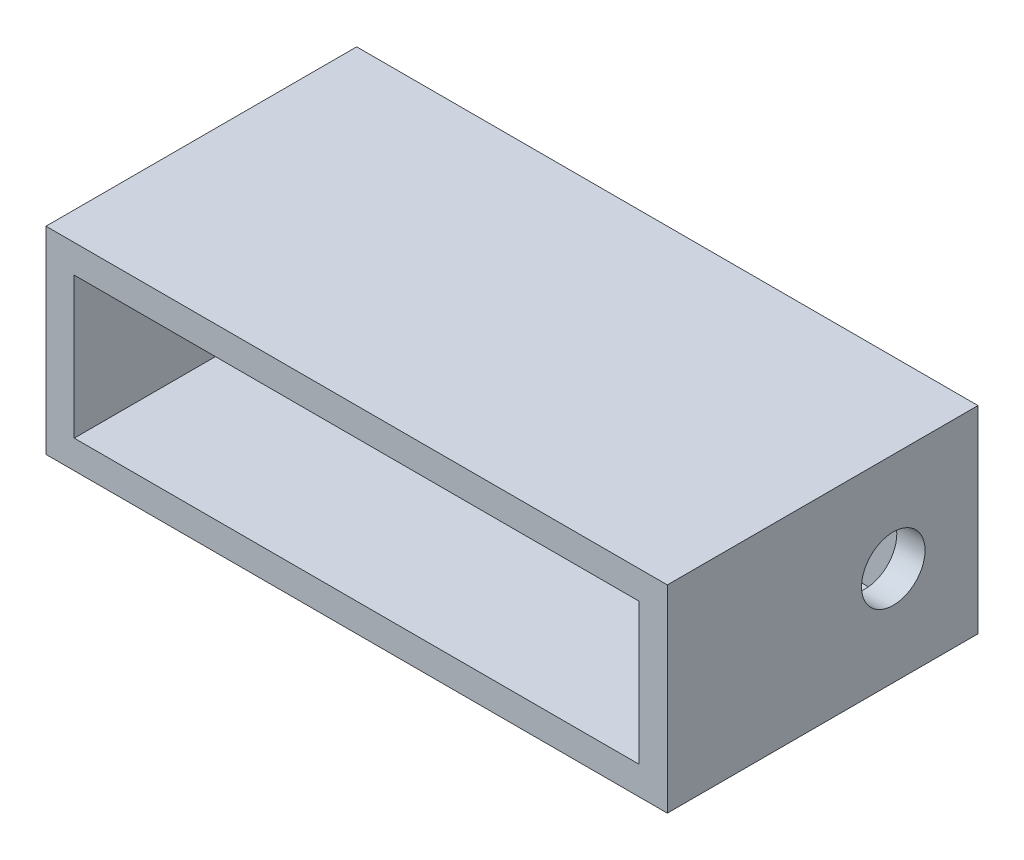
ISO-10303-21;
HEADER;
FILE_DESCRIPTION(('STEP AP214'),'2;1');
FILE_NAME('part.step','',(''),(''),'','','');
FILE_SCHEMA(('AUTOMOTIVE_DESIGN { 1 0 10303 214 1 1 1 1 }'));
ENDSEC;
DATA;
#1=APPLICATION_CONTEXT('core data for automotive mechanical design processes');
#2=APPLICATION_PROTOCOL_DEFINITION('international standard','automotive_design',2000,#1);
#3=PRODUCT_CONTEXT('',#1,'mechanical');
#4=PRODUCT('Part','Part','',(#3));
#5=PRODUCT_RELATED_PRODUCT_CATEGORY('part','',(#4));
#6=PRODUCT_DEFINITION_FORMATION('','',#4);
#7=PRODUCT_DEFINITION_CONTEXT('part definition',#1,'design');
#8=PRODUCT_DEFINITION('design','',#6,#7);
#9=PRODUCT_DEFINITION_SHAPE('','',#8);
#10=(LENGTH_UNIT() NAMED_UNIT(*) SI_UNIT(.MILLI.,.METRE.));
#11=(NAMED_UNIT(*) PLANE_ANGLE_UNIT() SI_UNIT($,.RADIAN.));
#12=(NAMED_UNIT(*) SI_UNIT($,.STERADIAN.) SOLID_ANGLE_UNIT());
#13=UNCERTAINTY_MEASURE_WITH_UNIT(LENGTH_MEASURE(1.E-05),#10,'distance_accuracy_value','');
#14=(GEOMETRIC_REPRESENTATION_CONTEXT(3) GLOBAL_UNCERTAINTY_ASSIGNED_CONTEXT((#13)) GLOBAL_UNIT_ASSIGNED_CONTEXT((#10,
#11,#12)) REPRESENTATION_CONTEXT('',''));
#15=CARTESIAN_POINT('',(0.,0.,0.));
#16=DIRECTION('',(0.,0.,1.));
#17=DIRECTION('',(1.,0.,0.));
#18=AXIS2_PLACEMENT_3D('',#15,#16,#17);
#19=CARTESIAN_POINT('',(-22.,-7.,22.));
#20=DIRECTION('',(1.,0.,0.));
#21=DIRECTION('',(0.,0.,-1.));
#22=AXIS2_PLACEMENT_3D('',#19,#20,#21);
#23=PLANE('',#22);
#24=DIRECTION('',(0.,-1.,0.));
#25=VECTOR('',#24,1.);
#26=CARTESIAN_POINT('',(-22.,-7.,0.));
#27=LINE('',#26,#25);
#28=CARTESIAN_POINT('',(-22.,7.,0.));
#29=VERTEX_POINT('',#28);
#30=CARTESIAN_POINT('',(-22.,-7.,0.));
#31=VERTEX_POINT('',#30);
#32=EDGE_CURVE('E144',#29,#31,#27,.T.);
#33=ORIENTED_EDGE('',*,*,#32,.T.);
#34=DIRECTION('',(0.,0.,-1.));
#35=VECTOR('',#34,1.);
#36=CARTESIAN_POINT('',(-22.,-7.,22.));
#37=LINE('',#36,#35);
#38=CARTESIAN_POINT('',(-22.,-7.,22.));
#39=VERTEX_POINT('',#38);
#40=EDGE_CURVE('E11',#39,#31,#37,.T.);
#41=ORIENTED_EDGE('',*,*,#40,.F.);
#42=DIRECTION('',(0.,-1.,0.));
#43=VECTOR('',#42,1.);
#44=CARTESIAN_POINT('',(-22.,-7.,22.));
#45=LINE('',#44,#43);
#46=CARTESIAN_POINT('',(-22.,7.,22.));
#47=VERTEX_POINT('',#46);
#48=EDGE_CURVE('E148',#47,#39,#45,.T.);
#49=ORIENTED_EDGE('',*,*,#48,.F.);
#50=DIRECTION('',(0.,0.,-1.));
#51=VECTOR('',#50,1.);
#52=CARTESIAN_POINT('',(-22.,7.,22.));
#53=LINE('',#52,#51);
#54=EDGE_CURVE('E154',#47,#29,#53,.T.);
#55=ORIENTED_EDGE('',*,*,#54,.T.);
#56=EDGE_LOOP('',(#33,#41,#49,#55));
#57=FACE_BOUND('',#56,.T.);
#58=ADVANCED_FACE('F33',(#57),#23,.F.);
#59=CARTESIAN_POINT('',(22.,-7.,22.));
#60=DIRECTION('',(0.,1.,0.));
#61=DIRECTION('',(-1.,0.,0.));
#62=AXIS2_PLACEMENT_3D('',#59,#60,#61);
#63=PLANE('',#62);
#64=DIRECTION('',(1.,0.,0.));
#65=VECTOR('',#64,1.);
#66=CARTESIAN_POINT('',(22.,-7.,0.));
#67=LINE('',#66,#65);
#68=CARTESIAN_POINT('',(22.,-7.,0.));
#69=VERTEX_POINT('',#68);
#70=EDGE_CURVE('E157',#31,#69,#67,.T.);
#71=ORIENTED_EDGE('',*,*,#70,.T.);
#72=DIRECTION('',(0.,0.,-1.));
#73=VECTOR('',#72,1.);
#74=CARTESIAN_POINT('',(22.,-7.,22.));
#75=LINE('',#74,#73);
#76=CARTESIAN_POINT('',(22.,-7.,22.));
#77=VERTEX_POINT('',#76);
#78=EDGE_CURVE('E41',#77,#69,#75,.T.);
#79=ORIENTED_EDGE('',*,*,#78,.F.);
#80=DIRECTION('',(1.,0.,0.));
#81=VECTOR('',#80,1.);
#82=CARTESIAN_POINT('',(22.,-7.,22.));
#83=LINE('',#82,#81);
#84=EDGE_CURVE('E85',#39,#77,#83,.T.);
#85=ORIENTED_EDGE('',*,*,#84,.F.);
#86=ORIENTED_EDGE('',*,*,#40,.T.);
#87=EDGE_LOOP('',(#71,#79,#85,#86));
#88=FACE_BOUND('',#87,.T.);
#89=ADVANCED_FACE('F187',(#88),#63,.F.);
#90=CARTESIAN_POINT('',(22.,-7.,22.));
#91=DIRECTION('',(-1.,0.,0.));
#92=DIRECTION('',(0.,0.,1.));
#93=AXIS2_PLACEMENT_3D('',#90,#91,#92);
#94=PLANE('',#93);
#95=CARTESIAN_POINT('',(22.,0.,6.));
#96=DIRECTION('',(1.,0.,0.));
#97=DIRECTION('',(0.,0.,-1.));
#98=AXIS2_PLACEMENT_3D('',#95,#96,#97);
#99=CIRCLE('',#98,2.25);
#100=CARTESIAN_POINT('',(22.,0.,3.75));
#101=VERTEX_POINT('',#100);
#102=EDGE_CURVE('E133',#101,#101,#99,.T.);
#103=ORIENTED_EDGE('',*,*,#102,.F.);
#104=EDGE_LOOP('',(#103));
#105=FACE_BOUND('',#104,.T.);
#106=DIRECTION('',(0.,1.,0.));
#107=VECTOR('',#106,1.);
#108=CARTESIAN_POINT('',(22.,-7.,0.));
#109=LINE('',#108,#107);
#110=CARTESIAN_POINT('',(22.,7.,0.));
#111=VERTEX_POINT('',#110);
#112=EDGE_CURVE('E159',#69,#111,#109,.T.);
#113=ORIENTED_EDGE('',*,*,#112,.T.);
#114=DIRECTION('',(0.,0.,-1.));
#115=VECTOR('',#114,1.);
#116=CARTESIAN_POINT('',(22.,7.,22.));
#117=LINE('',#116,#115);
#118=CARTESIAN_POINT('',(22.,7.,22.));
#119=VERTEX_POINT('',#118);
#120=EDGE_CURVE('E163',#119,#111,#117,.T.);
#121=ORIENTED_EDGE('',*,*,#120,.F.);
#122=DIRECTION('',(0.,1.,0.));
#123=VECTOR('',#122,1.);
#124=CARTESIAN_POINT('',(22.,-7.,22.));
#125=LINE('',#124,#123);
#126=EDGE_CURVE('E151',#77,#119,#125,.T.);
#127=ORIENTED_EDGE('',*,*,#126,.F.);
#128=ORIENTED_EDGE('',*,*,#78,.T.);
#129=EDGE_LOOP('',(#113,#121,#127,#128));
#130=FACE_BOUND('',#129,.T.);
#131=ADVANCED_FACE('F169',(#105,#130),#94,.F.);
#132=CARTESIAN_POINT('',(22.,7.,22.));
#133=DIRECTION('',(0.,-1.,0.));
#134=DIRECTION('',(1.,0.,0.));
#135=AXIS2_PLACEMENT_3D('',#132,#133,#134);
#136=PLANE('',#135);
#137=DIRECTION('',(-1.,0.,0.));
#138=VECTOR('',#137,1.);
#139=CARTESIAN_POINT('',(22.,7.,0.));
#140=LINE('',#139,#138);
#141=EDGE_CURVE('E78',#111,#29,#140,.T.);
#142=ORIENTED_EDGE('',*,*,#141,.T.);
#143=ORIENTED_EDGE('',*,*,#54,.F.);
#144=DIRECTION('',(-1.,0.,0.));
#145=VECTOR('',#144,1.);
#146=CARTESIAN_POINT('',(22.,7.,22.));
#147=LINE('',#146,#145);
#148=EDGE_CURVE('E57',#119,#47,#147,.T.);
#149=ORIENTED_EDGE('',*,*,#148,.F.);
#150=ORIENTED_EDGE('',*,*,#120,.T.);
#151=EDGE_LOOP('',(#142,#143,#149,#150));
#152=FACE_BOUND('',#151,.T.);
#153=ADVANCED_FACE('F177',(#152),#136,.F.);
#154=CARTESIAN_POINT('',(0.,0.,22.));
#155=DIRECTION('',(0.,0.,1.));
#156=DIRECTION('',(1.,0.,0.));
#157=AXIS2_PLACEMENT_3D('',#154,#155,#156);
#158=PLANE('',#157);
#159=DIRECTION('',(0.,-1.,0.));
#160=VECTOR('',#159,1.);
#161=CARTESIAN_POINT('',(-20.,-5.,22.));
#162=LINE('',#161,#160);
#163=CARTESIAN_POINT('',(-20.,5.,22.));
#164=VERTEX_POINT('',#163);
#165=CARTESIAN_POINT('',(-20.,-5.,22.));
#166=VERTEX_POINT('',#165);
#167=EDGE_CURVE('E48',#164,#166,#162,.T.);
#168=ORIENTED_EDGE('',*,*,#167,.F.);
#169=DIRECTION('',(-1.,0.,0.));
#170=VECTOR('',#169,1.);
#171=CARTESIAN_POINT('',(20.,5.,22.));
#172=LINE('',#171,#170);
#173=CARTESIAN_POINT('',(20.,5.,22.));
#174=VERTEX_POINT('',#173);
#175=EDGE_CURVE('E127',#174,#164,#172,.T.);
#176=ORIENTED_EDGE('',*,*,#175,.F.);
#177=DIRECTION('',(0.,1.,0.));
#178=VECTOR('',#177,1.);
#179=CARTESIAN_POINT('',(20.,-5.,22.));
#180=LINE('',#179,#178);
#181=CARTESIAN_POINT('',(20.,-5.,22.));
#182=VERTEX_POINT('',#181);
#183=EDGE_CURVE('E130',#182,#174,#180,.T.);
#184=ORIENTED_EDGE('',*,*,#183,.F.);
#185=DIRECTION('',(1.,0.,0.));
#186=VECTOR('',#185,1.);
#187=CARTESIAN_POINT('',(20.,-5.,22.));
#188=LINE('',#187,#186);
#189=EDGE_CURVE('E138',#166,#182,#188,.T.);
#190=ORIENTED_EDGE('',*,*,#189,.F.);
#191=EDGE_LOOP('',(#168,#176,#184,#190));
#192=FACE_BOUND('',#191,.T.);
#193=ORIENTED_EDGE('',*,*,#48,.T.);
#194=ORIENTED_EDGE('',*,*,#84,.T.);
#195=ORIENTED_EDGE('',*,*,#126,.T.);
#196=ORIENTED_EDGE('',*,*,#148,.T.);
#197=EDGE_LOOP('',(#193,#194,#195,#196));
#198=FACE_BOUND('',#197,.T.);
#199=ADVANCED_FACE('F179',(#192,#198),#158,.T.);
#200=CARTESIAN_POINT('',(0.,0.,0.));
#201=DIRECTION('',(0.,0.,1.));
#202=DIRECTION('',(1.,0.,0.));
#203=AXIS2_PLACEMENT_3D('',#200,#201,#202);
#204=PLANE('',#203);
#205=ORIENTED_EDGE('',*,*,#32,.F.);
#206=ORIENTED_EDGE('',*,*,#141,.F.);
#207=ORIENTED_EDGE('',*,*,#112,.F.);
#208=ORIENTED_EDGE('',*,*,#70,.F.);
#209=EDGE_LOOP('',(#205,#206,#207,#208));
#210=FACE_BOUND('',#209,.T.);
#211=ADVANCED_FACE('F173',(#210),#204,.F.);
#212=CARTESIAN_POINT('',(-20.,-5.,3.));
#213=DIRECTION('',(-1.,0.,0.));
#214=DIRECTION('',(0.,0.,1.));
#215=AXIS2_PLACEMENT_3D('',#212,#213,#214);
#216=PLANE('',#215);
#217=ORIENTED_EDGE('',*,*,#167,.T.);
#218=DIRECTION('',(0.,0.,1.));
#219=VECTOR('',#218,1.);
#220=CARTESIAN_POINT('',(-20.,-5.,3.));
#221=LINE('',#220,#219);
#222=CARTESIAN_POINT('',(-20.,-5.,3.));
#223=VERTEX_POINT('',#222);
#224=EDGE_CURVE('E105',#223,#166,#221,.T.);
#225=ORIENTED_EDGE('',*,*,#224,.F.);
#226=DIRECTION('',(0.,-1.,0.));
#227=VECTOR('',#226,1.);
#228=CARTESIAN_POINT('',(-20.,-5.,3.));
#229=LINE('',#228,#227);
#230=CARTESIAN_POINT('',(-20.,5.,3.));
#231=VERTEX_POINT('',#230);
#232=EDGE_CURVE('E109',#231,#223,#229,.T.);
#233=ORIENTED_EDGE('',*,*,#232,.F.);
#234=DIRECTION('',(0.,0.,1.));
#235=VECTOR('',#234,1.);
#236=CARTESIAN_POINT('',(-20.,5.,3.));
#237=LINE('',#236,#235);
#238=EDGE_CURVE('E142',#231,#164,#237,.T.);
#239=ORIENTED_EDGE('',*,*,#238,.T.);
#240=EDGE_LOOP('',(#217,#225,#233,#239));
#241=FACE_BOUND('',#240,.T.);
#242=ADVANCED_FACE('F107',(#241),#216,.F.);
#243=CARTESIAN_POINT('',(20.,5.,3.));
#244=DIRECTION('',(0.,1.,0.));
#245=DIRECTION('',(-1.,0.,0.));
#246=AXIS2_PLACEMENT_3D('',#243,#244,#245);
#247=PLANE('',#246);
#248=ORIENTED_EDGE('',*,*,#175,.T.);
#249=ORIENTED_EDGE('',*,*,#238,.F.);
#250=DIRECTION('',(-1.,0.,0.));
#251=VECTOR('',#250,1.);
#252=CARTESIAN_POINT('',(20.,5.,3.));
#253=LINE('',#252,#251);
#254=CARTESIAN_POINT('',(20.,5.,3.));
#255=VERTEX_POINT('',#254);
#256=EDGE_CURVE('E115',#255,#231,#253,.T.);
#257=ORIENTED_EDGE('',*,*,#256,.F.);
#258=DIRECTION('',(0.,0.,1.));
#259=VECTOR('',#258,1.);
#260=CARTESIAN_POINT('',(20.,5.,3.));
#261=LINE('',#260,#259);
#262=EDGE_CURVE('E145',#255,#174,#261,.T.);
#263=ORIENTED_EDGE('',*,*,#262,.T.);
#264=EDGE_LOOP('',(#248,#249,#257,#263));
#265=FACE_BOUND('',#264,.T.);
#266=ADVANCED_FACE('F217',(#265),#247,.F.);
#267=CARTESIAN_POINT('',(20.,-5.,3.));
#268=DIRECTION('',(1.,0.,0.));
#269=DIRECTION('',(0.,0.,-1.));
#270=AXIS2_PLACEMENT_3D('',#267,#268,#269);
#271=PLANE('',#270);
#272=CARTESIAN_POINT('',(20.,0.,6.));
#273=DIRECTION('',(1.,0.,0.));
#274=DIRECTION('',(0.,0.,-1.));
#275=AXIS2_PLACEMENT_3D('',#272,#273,#274);
#276=CIRCLE('',#275,2.25);
#277=CARTESIAN_POINT('',(20.,0.,3.75));
#278=VERTEX_POINT('',#277);
#279=EDGE_CURVE('E36',#278,#278,#276,.T.);
#280=ORIENTED_EDGE('',*,*,#279,.T.);
#281=EDGE_LOOP('',(#280));
#282=FACE_BOUND('',#281,.T.);
#283=ORIENTED_EDGE('',*,*,#183,.T.);
#284=ORIENTED_EDGE('',*,*,#262,.F.);
#285=DIRECTION('',(0.,1.,0.));
#286=VECTOR('',#285,1.);
#287=CARTESIAN_POINT('',(20.,-5.,3.));
#288=LINE('',#287,#286);
#289=CARTESIAN_POINT('',(20.,-5.,3.));
#290=VERTEX_POINT('',#289);
#291=EDGE_CURVE('E123',#290,#255,#288,.T.);
#292=ORIENTED_EDGE('',*,*,#291,.F.);
#293=DIRECTION('',(0.,0.,1.));
#294=VECTOR('',#293,1.);
#295=CARTESIAN_POINT('',(20.,-5.,3.));
#296=LINE('',#295,#294);
#297=EDGE_CURVE('E114',#290,#182,#296,.T.);
#298=ORIENTED_EDGE('',*,*,#297,.T.);
#299=EDGE_LOOP('',(#283,#284,#292,#298));
#300=FACE_BOUND('',#299,.T.);
#301=ADVANCED_FACE('F212',(#282,#300),#271,.F.);
#302=CARTESIAN_POINT('',(20.,-5.,3.));
#303=DIRECTION('',(0.,-1.,0.));
#304=DIRECTION('',(1.,0.,0.));
#305=AXIS2_PLACEMENT_3D('',#302,#303,#304);
#306=PLANE('',#305);
#307=ORIENTED_EDGE('',*,*,#189,.T.);
#308=ORIENTED_EDGE('',*,*,#297,.F.);
#309=DIRECTION('',(1.,0.,0.));
#310=VECTOR('',#309,1.);
#311=CARTESIAN_POINT('',(20.,-5.,3.));
#312=LINE('',#311,#310);
#313=EDGE_CURVE('E118',#223,#290,#312,.T.);
#314=ORIENTED_EDGE('',*,*,#313,.F.);
#315=ORIENTED_EDGE('',*,*,#224,.T.);
#316=EDGE_LOOP('',(#307,#308,#314,#315));
#317=FACE_BOUND('',#316,.T.);
#318=ADVANCED_FACE('F119',(#317),#306,.F.);
#319=CARTESIAN_POINT('',(0.,0.,3.));
#320=DIRECTION('',(0.,0.,1.));
#321=DIRECTION('',(1.,0.,0.));
#322=AXIS2_PLACEMENT_3D('',#319,#320,#321);
#323=PLANE('',#322);
#324=ORIENTED_EDGE('',*,*,#232,.T.);
#325=ORIENTED_EDGE('',*,*,#313,.T.);
#326=ORIENTED_EDGE('',*,*,#291,.T.);
#327=ORIENTED_EDGE('',*,*,#256,.T.);
#328=EDGE_LOOP('',(#324,#325,#326,#327));
#329=FACE_BOUND('',#328,.T.);
#330=ADVANCED_FACE('F125',(#329),#323,.T.);
#331=CARTESIAN_POINT('',(17.,0.,6.));
#332=DIRECTION('',(1.,0.,0.));
#333=DIRECTION('',(0.,0.,-1.));
#334=AXIS2_PLACEMENT_3D('',#331,#332,#333);
#335=CYLINDRICAL_SURFACE('',#334,2.25);
#336=ORIENTED_EDGE('',*,*,#102,.T.);
#337=EDGE_LOOP('',(#336));
#338=FACE_BOUND('',#337,.T.);
#339=ORIENTED_EDGE('',*,*,#279,.F.);
#340=EDGE_LOOP('',(#339));
#341=FACE_BOUND('',#340,.T.);
#342=ADVANCED_FACE('F227',(#338,#341),#335,.F.);
#343=CLOSED_SHELL('',(#58,#89,#131,#153,#199,#211,#242,#266,#301,#318,#330,#342));
#344=MANIFOLD_SOLID_BREP('B2',#343);
#345=ADVANCED_BREP_SHAPE_REPRESENTATION('',(#18,#344),#14);
#346=SHAPE_DEFINITION_REPRESENTATION(#9,#345);
ENDSEC;
END-ISO-10303-21;
